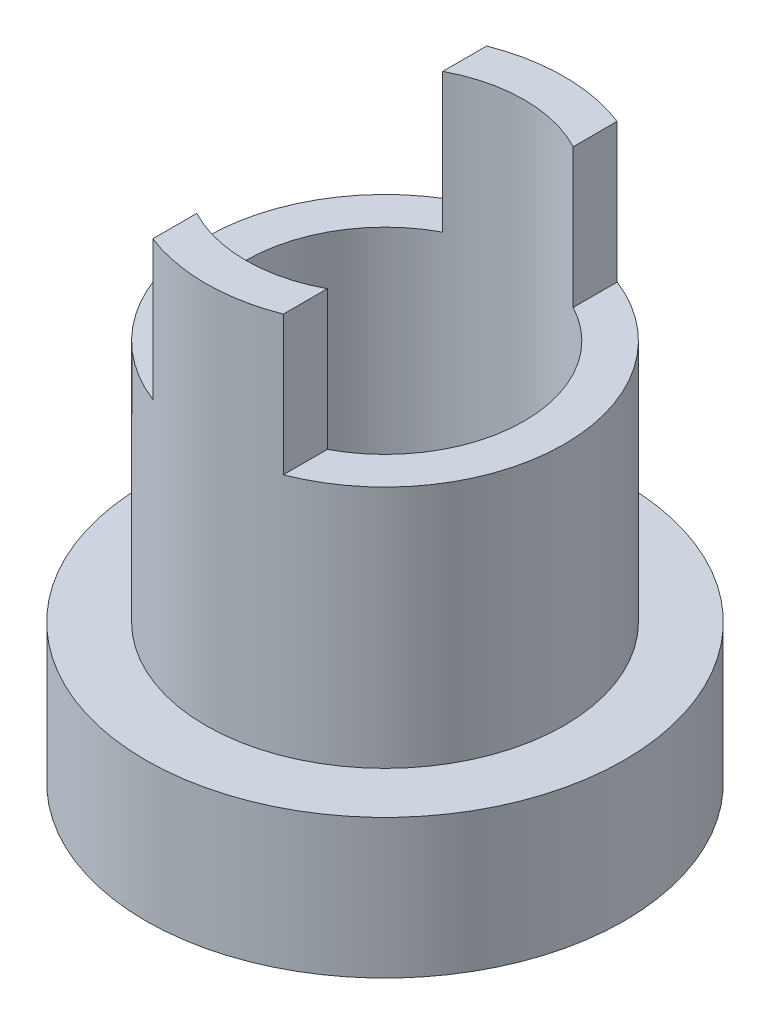
ISO-10303-21;
HEADER;
FILE_DESCRIPTION(('STEP AP214'),'2;1');
FILE_NAME('part.step','',(''),(''),'','','');
FILE_SCHEMA(('AUTOMOTIVE_DESIGN { 1 0 10303 214 1 1 1 1 }'));
ENDSEC;
DATA;
#1=APPLICATION_CONTEXT('core data for automotive mechanical design processes');
#2=APPLICATION_PROTOCOL_DEFINITION('international standard','automotive_design',2000,#1);
#3=PRODUCT_CONTEXT('',#1,'mechanical');
#4=PRODUCT('Part','Part','',(#3));
#5=PRODUCT_RELATED_PRODUCT_CATEGORY('part','',(#4));
#6=PRODUCT_DEFINITION_FORMATION('','',#4);
#7=PRODUCT_DEFINITION_CONTEXT('part definition',#1,'design');
#8=PRODUCT_DEFINITION('design','',#6,#7);
#9=PRODUCT_DEFINITION_SHAPE('','',#8);
#10=(LENGTH_UNIT() NAMED_UNIT(*) SI_UNIT(.MILLI.,.METRE.));
#11=(NAMED_UNIT(*) PLANE_ANGLE_UNIT() SI_UNIT($,.RADIAN.));
#12=(NAMED_UNIT(*) SI_UNIT($,.STERADIAN.) SOLID_ANGLE_UNIT());
#13=UNCERTAINTY_MEASURE_WITH_UNIT(LENGTH_MEASURE(1.E-05),#10,'distance_accuracy_value','');
#14=(GEOMETRIC_REPRESENTATION_CONTEXT(3) GLOBAL_UNCERTAINTY_ASSIGNED_CONTEXT((#13)) GLOBAL_UNIT_ASSIGNED_CONTEXT((#10,
#11,#12)) REPRESENTATION_CONTEXT('',''));
#15=CARTESIAN_POINT('',(0.,0.,0.));
#16=DIRECTION('',(0.,0.,1.));
#17=DIRECTION('',(1.,0.,0.));
#18=AXIS2_PLACEMENT_3D('',#15,#16,#17);
#19=CARTESIAN_POINT('',(0.,4.,0.));
#20=DIRECTION('',(0.,1.,0.));
#21=DIRECTION('',(0.,0.,1.));
#22=AXIS2_PLACEMENT_3D('',#19,#20,#21);
#23=PLANE('',#22);
#24=CARTESIAN_POINT('',(0.,4.,0.));
#25=DIRECTION('',(0.,1.,0.));
#26=DIRECTION('',(0.,0.,1.));
#27=AXIS2_PLACEMENT_3D('',#24,#25,#26);
#28=CIRCLE('',#27,5.15);
#29=CARTESIAN_POINT('',(0.,4.,5.15));
#30=VERTEX_POINT('',#29);
#31=EDGE_CURVE('E19',#30,#30,#28,.T.);
#32=ORIENTED_EDGE('',*,*,#31,.F.);
#33=EDGE_LOOP('',(#32));
#34=FACE_BOUND('',#33,.T.);
#35=CARTESIAN_POINT('',(0.,4.,0.));
#36=DIRECTION('',(0.,1.,0.));
#37=DIRECTION('',(0.,0.,1.));
#38=AXIS2_PLACEMENT_3D('',#35,#36,#37);
#39=CIRCLE('',#38,6.875);
#40=CARTESIAN_POINT('',(0.,4.,6.875));
#41=VERTEX_POINT('',#40);
#42=EDGE_CURVE('E103',#41,#41,#39,.F.);
#43=ORIENTED_EDGE('',*,*,#42,.F.);
#44=EDGE_LOOP('',(#43));
#45=FACE_BOUND('',#44,.T.);
#46=ADVANCED_FACE('F16',(#34,#45),#23,.T.);
#47=CARTESIAN_POINT('',(0.,4.,0.));
#48=DIRECTION('',(0.,1.,0.));
#49=DIRECTION('',(0.,0.,1.));
#50=AXIS2_PLACEMENT_3D('',#47,#48,#49);
#51=CYLINDRICAL_SURFACE('',#50,5.15);
#52=ORIENTED_EDGE('',*,*,#31,.T.);
#53=EDGE_LOOP('',(#52));
#54=FACE_BOUND('',#53,.T.);
#55=DIRECTION('',(0.,1.,0.));
#56=VECTOR('',#55,1.);
#57=CARTESIAN_POINT('',(1.875,13.,4.7965482380562));
#58=LINE('',#57,#56);
#59=CARTESIAN_POINT('',(1.875,15.,4.7965482380562));
#60=VERTEX_POINT('',#59);
#61=CARTESIAN_POINT('',(1.875,11.,4.7965482380562));
#62=VERTEX_POINT('',#61);
#63=EDGE_CURVE('E126',#60,#62,#58,.F.);
#64=ORIENTED_EDGE('',*,*,#63,.F.);
#65=CARTESIAN_POINT('',(0.,15.,0.));
#66=DIRECTION('',(0.,1.,0.));
#67=DIRECTION('',(0.,0.,1.));
#68=AXIS2_PLACEMENT_3D('',#65,#66,#67);
#69=CIRCLE('',#68,5.15);
#70=CARTESIAN_POINT('',(-1.875,15.,4.7965482380562));
#71=VERTEX_POINT('',#70);
#72=EDGE_CURVE('E112',#71,#60,#69,.T.);
#73=ORIENTED_EDGE('',*,*,#72,.F.);
#74=DIRECTION('',(0.,1.,0.));
#75=VECTOR('',#74,1.);
#76=CARTESIAN_POINT('',(-1.875,13.,4.7965482380562));
#77=LINE('',#76,#75);
#78=CARTESIAN_POINT('',(-1.875,11.,4.7965482380562));
#79=VERTEX_POINT('',#78);
#80=EDGE_CURVE('E106',#71,#79,#77,.F.);
#81=ORIENTED_EDGE('',*,*,#80,.T.);
#82=CARTESIAN_POINT('',(0.,11.,0.));
#83=DIRECTION('',(0.,1.,0.));
#84=DIRECTION('',(0.,0.,1.));
#85=AXIS2_PLACEMENT_3D('',#82,#83,#84);
#86=CIRCLE('',#85,5.15);
#87=CARTESIAN_POINT('',(-1.875,11.,-4.7965482380562));
#88=VERTEX_POINT('',#87);
#89=EDGE_CURVE('E93',#79,#88,#86,.F.);
#90=ORIENTED_EDGE('',*,*,#89,.T.);
#91=DIRECTION('',(0.,1.,0.));
#92=VECTOR('',#91,1.);
#93=CARTESIAN_POINT('',(-1.875,13.,-4.7965482380562));
#94=LINE('',#93,#92);
#95=CARTESIAN_POINT('',(-1.875,15.,-4.7965482380562));
#96=VERTEX_POINT('',#95);
#97=EDGE_CURVE('E136',#88,#96,#94,.T.);
#98=ORIENTED_EDGE('',*,*,#97,.T.);
#99=CARTESIAN_POINT('',(0.,15.,0.));
#100=DIRECTION('',(0.,1.,0.));
#101=DIRECTION('',(0.,0.,1.));
#102=AXIS2_PLACEMENT_3D('',#99,#100,#101);
#103=CIRCLE('',#102,5.15);
#104=CARTESIAN_POINT('',(1.875,15.,-4.7965482380562));
#105=VERTEX_POINT('',#104);
#106=EDGE_CURVE('E135',#105,#96,#103,.T.);
#107=ORIENTED_EDGE('',*,*,#106,.F.);
#108=DIRECTION('',(0.,1.,0.));
#109=VECTOR('',#108,1.);
#110=CARTESIAN_POINT('',(1.875,13.,-4.7965482380562));
#111=LINE('',#110,#109);
#112=CARTESIAN_POINT('',(1.875,11.,-4.7965482380562));
#113=VERTEX_POINT('',#112);
#114=EDGE_CURVE('E131',#113,#105,#111,.T.);
#115=ORIENTED_EDGE('',*,*,#114,.F.);
#116=CARTESIAN_POINT('',(0.,11.,0.));
#117=DIRECTION('',(0.,1.,0.));
#118=DIRECTION('',(0.,0.,1.));
#119=AXIS2_PLACEMENT_3D('',#116,#117,#118);
#120=CIRCLE('',#119,5.15);
#121=EDGE_CURVE('E130',#113,#62,#120,.F.);
#122=ORIENTED_EDGE('',*,*,#121,.T.);
#123=EDGE_LOOP('',(#64,#73,#81,#90,#98,#107,#115,#122));
#124=FACE_BOUND('',#123,.T.);
#125=ADVANCED_FACE('F111',(#54,#124),#51,.T.);
#126=CARTESIAN_POINT('',(0.,0.,0.));
#127=DIRECTION('',(0.,1.,0.));
#128=DIRECTION('',(0.,0.,1.));
#129=AXIS2_PLACEMENT_3D('',#126,#127,#128);
#130=CYLINDRICAL_SURFACE('',#129,6.875);
#131=CARTESIAN_POINT('',(0.,0.,0.));
#132=DIRECTION('',(0.,1.,0.));
#133=DIRECTION('',(0.,0.,1.));
#134=AXIS2_PLACEMENT_3D('',#131,#132,#133);
#135=CIRCLE('',#134,6.875);
#136=CARTESIAN_POINT('',(0.,0.,6.875));
#137=VERTEX_POINT('',#136);
#138=EDGE_CURVE('E114',#137,#137,#135,.T.);
#139=ORIENTED_EDGE('',*,*,#138,.T.);
#140=EDGE_LOOP('',(#139));
#141=FACE_BOUND('',#140,.T.);
#142=ORIENTED_EDGE('',*,*,#42,.T.);
#143=EDGE_LOOP('',(#142));
#144=FACE_BOUND('',#143,.T.);
#145=ADVANCED_FACE('F176',(#141,#144),#130,.T.);
#146=CARTESIAN_POINT('',(-1.875,11.,-6.23674060833547));
#147=DIRECTION('',(0.,-1.,0.));
#148=DIRECTION('',(0.,0.,-1.));
#149=AXIS2_PLACEMENT_3D('',#146,#147,#148);
#150=PLANE('',#149);
#151=DIRECTION('',(0.,0.,-1.));
#152=VECTOR('',#151,1.);
#153=CARTESIAN_POINT('',(-1.875,11.,-0.0726574679316326));
#154=LINE('',#153,#152);
#155=CARTESIAN_POINT('',(-1.875,11.,3.53332350627564));
#156=VERTEX_POINT('',#155);
#157=EDGE_CURVE('E97',#79,#156,#154,.T.);
#158=ORIENTED_EDGE('',*,*,#157,.T.);
#159=CARTESIAN_POINT('',(0.,11.,0.));
#160=DIRECTION('',(0.,1.,0.));
#161=DIRECTION('',(0.,0.,1.));
#162=AXIS2_PLACEMENT_3D('',#159,#160,#161);
#163=CIRCLE('',#162,4.);
#164=CARTESIAN_POINT('',(-1.875,11.,-3.53332350627564));
#165=VERTEX_POINT('',#164);
#166=EDGE_CURVE('E120',#156,#165,#163,.F.);
#167=ORIENTED_EDGE('',*,*,#166,.T.);
#168=DIRECTION('',(0.,0.,-1.));
#169=VECTOR('',#168,1.);
#170=CARTESIAN_POINT('',(-1.875,11.,-0.0726574679316326));
#171=LINE('',#170,#169);
#172=EDGE_CURVE('E98',#165,#88,#171,.T.);
#173=ORIENTED_EDGE('',*,*,#172,.T.);
#174=ORIENTED_EDGE('',*,*,#89,.F.);
#175=EDGE_LOOP('',(#158,#167,#173,#174));
#176=FACE_BOUND('',#175,.T.);
#177=ADVANCED_FACE('F95',(#176),#150,.F.);
#178=CARTESIAN_POINT('',(-1.875,13.,-0.0726574679316326));
#179=DIRECTION('',(1.,0.,0.));
#180=DIRECTION('',(0.,0.,-1.));
#181=AXIS2_PLACEMENT_3D('',#178,#179,#180);
#182=PLANE('',#181);
#183=ORIENTED_EDGE('',*,*,#172,.F.);
#184=DIRECTION('',(0.,1.,0.));
#185=VECTOR('',#184,1.);
#186=CARTESIAN_POINT('',(-1.875,0.,-3.53332350627564));
#187=LINE('',#186,#185);
#188=CARTESIAN_POINT('',(-1.875,15.,-3.53332350627564));
#189=VERTEX_POINT('',#188);
#190=EDGE_CURVE('E152',#165,#189,#187,.T.);
#191=ORIENTED_EDGE('',*,*,#190,.T.);
#192=DIRECTION('',(0.,0.,1.));
#193=VECTOR('',#192,1.);
#194=CARTESIAN_POINT('',(-1.875,15.,0.));
#195=LINE('',#194,#193);
#196=EDGE_CURVE('E137',#96,#189,#195,.T.);
#197=ORIENTED_EDGE('',*,*,#196,.F.);
#198=ORIENTED_EDGE('',*,*,#97,.F.);
#199=EDGE_LOOP('',(#183,#191,#197,#198));
#200=FACE_BOUND('',#199,.T.);
#201=ADVANCED_FACE('F210',(#200),#182,.F.);
#202=CARTESIAN_POINT('',(0.,15.,0.));
#203=DIRECTION('',(0.,1.,0.));
#204=DIRECTION('',(0.,0.,1.));
#205=AXIS2_PLACEMENT_3D('',#202,#203,#204);
#206=PLANE('',#205);
#207=DIRECTION('',(0.,0.,-1.));
#208=VECTOR('',#207,1.);
#209=CARTESIAN_POINT('',(1.875,15.,0.));
#210=LINE('',#209,#208);
#211=CARTESIAN_POINT('',(1.875,15.,-3.53332350627564));
#212=VERTEX_POINT('',#211);
#213=EDGE_CURVE('E134',#105,#212,#210,.F.);
#214=ORIENTED_EDGE('',*,*,#213,.F.);
#215=ORIENTED_EDGE('',*,*,#106,.T.);
#216=ORIENTED_EDGE('',*,*,#196,.T.);
#217=CARTESIAN_POINT('',(0.,15.,0.));
#218=DIRECTION('',(0.,1.,0.));
#219=DIRECTION('',(0.,0.,1.));
#220=AXIS2_PLACEMENT_3D('',#217,#218,#219);
#221=CIRCLE('',#220,4.);
#222=EDGE_CURVE('E149',#189,#212,#221,.F.);
#223=ORIENTED_EDGE('',*,*,#222,.T.);
#224=EDGE_LOOP('',(#214,#215,#216,#223));
#225=FACE_BOUND('',#224,.T.);
#226=ADVANCED_FACE('F206',(#225),#206,.T.);
#227=CARTESIAN_POINT('',(1.875,13.,0.));
#228=DIRECTION('',(1.,0.,0.));
#229=DIRECTION('',(0.,0.,-1.));
#230=AXIS2_PLACEMENT_3D('',#227,#228,#229);
#231=PLANE('',#230);
#232=DIRECTION('',(0.,1.,0.));
#233=VECTOR('',#232,1.);
#234=CARTESIAN_POINT('',(1.875,0.,-3.53332350627564));
#235=LINE('',#234,#233);
#236=CARTESIAN_POINT('',(1.875,11.,-3.53332350627564));
#237=VERTEX_POINT('',#236);
#238=EDGE_CURVE('E148',#212,#237,#235,.F.);
#239=ORIENTED_EDGE('',*,*,#238,.T.);
#240=DIRECTION('',(0.,0.,-1.));
#241=VECTOR('',#240,1.);
#242=CARTESIAN_POINT('',(1.875,11.,5.15));
#243=LINE('',#242,#241);
#244=EDGE_CURVE('E159',#237,#113,#243,.T.);
#245=ORIENTED_EDGE('',*,*,#244,.T.);
#246=ORIENTED_EDGE('',*,*,#114,.T.);
#247=ORIENTED_EDGE('',*,*,#213,.T.);
#248=EDGE_LOOP('',(#239,#245,#246,#247));
#249=FACE_BOUND('',#248,.T.);
#250=ADVANCED_FACE('F202',(#249),#231,.T.);
#251=CARTESIAN_POINT('',(1.875,11.,5.15));
#252=DIRECTION('',(0.,-1.,0.));
#253=DIRECTION('',(0.,0.,-1.));
#254=AXIS2_PLACEMENT_3D('',#251,#252,#253);
#255=PLANE('',#254);
#256=ORIENTED_EDGE('',*,*,#244,.F.);
#257=CARTESIAN_POINT('',(0.,11.,0.));
#258=DIRECTION('',(0.,1.,0.));
#259=DIRECTION('',(0.,0.,1.));
#260=AXIS2_PLACEMENT_3D('',#257,#258,#259);
#261=CIRCLE('',#260,4.);
#262=CARTESIAN_POINT('',(1.875,11.,3.53332350627564));
#263=VERTEX_POINT('',#262);
#264=EDGE_CURVE('E144',#237,#263,#261,.F.);
#265=ORIENTED_EDGE('',*,*,#264,.T.);
#266=DIRECTION('',(0.,0.,-1.));
#267=VECTOR('',#266,1.);
#268=CARTESIAN_POINT('',(1.875,11.,0.));
#269=LINE('',#268,#267);
#270=EDGE_CURVE('E129',#62,#263,#269,.T.);
#271=ORIENTED_EDGE('',*,*,#270,.F.);
#272=ORIENTED_EDGE('',*,*,#121,.F.);
#273=EDGE_LOOP('',(#256,#265,#271,#272));
#274=FACE_BOUND('',#273,.T.);
#275=ADVANCED_FACE('F198',(#274),#255,.F.);
#276=CARTESIAN_POINT('',(1.875,13.,0.));
#277=DIRECTION('',(1.,0.,0.));
#278=DIRECTION('',(0.,0.,-1.));
#279=AXIS2_PLACEMENT_3D('',#276,#277,#278);
#280=PLANE('',#279);
#281=DIRECTION('',(0.,1.,0.));
#282=VECTOR('',#281,1.);
#283=CARTESIAN_POINT('',(1.875,0.,3.53332350627564));
#284=LINE('',#283,#282);
#285=CARTESIAN_POINT('',(1.875,15.,3.53332350627564));
#286=VERTEX_POINT('',#285);
#287=EDGE_CURVE('E143',#263,#286,#284,.T.);
#288=ORIENTED_EDGE('',*,*,#287,.T.);
#289=DIRECTION('',(0.,0.,1.));
#290=VECTOR('',#289,1.);
#291=CARTESIAN_POINT('',(1.875,15.,0.));
#292=LINE('',#291,#290);
#293=EDGE_CURVE('E108',#60,#286,#292,.F.);
#294=ORIENTED_EDGE('',*,*,#293,.F.);
#295=ORIENTED_EDGE('',*,*,#63,.T.);
#296=ORIENTED_EDGE('',*,*,#270,.T.);
#297=EDGE_LOOP('',(#288,#294,#295,#296));
#298=FACE_BOUND('',#297,.T.);
#299=ADVANCED_FACE('F195',(#298),#280,.T.);
#300=CARTESIAN_POINT('',(0.,15.,0.));
#301=DIRECTION('',(0.,1.,0.));
#302=DIRECTION('',(0.,0.,1.));
#303=AXIS2_PLACEMENT_3D('',#300,#301,#302);
#304=PLANE('',#303);
#305=ORIENTED_EDGE('',*,*,#293,.T.);
#306=CARTESIAN_POINT('',(0.,15.,0.));
#307=DIRECTION('',(0.,1.,0.));
#308=DIRECTION('',(0.,0.,1.));
#309=AXIS2_PLACEMENT_3D('',#306,#307,#308);
#310=CIRCLE('',#309,4.);
#311=CARTESIAN_POINT('',(-1.875,15.,3.53332350627564));
#312=VERTEX_POINT('',#311);
#313=EDGE_CURVE('E139',#286,#312,#310,.F.);
#314=ORIENTED_EDGE('',*,*,#313,.T.);
#315=DIRECTION('',(0.,0.,-1.));
#316=VECTOR('',#315,1.);
#317=CARTESIAN_POINT('',(-1.875,15.,-0.0726574679316326));
#318=LINE('',#317,#316);
#319=EDGE_CURVE('E38',#312,#71,#318,.F.);
#320=ORIENTED_EDGE('',*,*,#319,.T.);
#321=ORIENTED_EDGE('',*,*,#72,.T.);
#322=EDGE_LOOP('',(#305,#314,#320,#321));
#323=FACE_BOUND('',#322,.T.);
#324=ADVANCED_FACE('F192',(#323),#304,.T.);
#325=CARTESIAN_POINT('',(-1.875,13.,-0.0726574679316326));
#326=DIRECTION('',(1.,0.,0.));
#327=DIRECTION('',(0.,0.,-1.));
#328=AXIS2_PLACEMENT_3D('',#325,#326,#327);
#329=PLANE('',#328);
#330=ORIENTED_EDGE('',*,*,#319,.F.);
#331=DIRECTION('',(0.,1.,0.));
#332=VECTOR('',#331,1.);
#333=CARTESIAN_POINT('',(-1.875,0.,3.53332350627564));
#334=LINE('',#333,#332);
#335=EDGE_CURVE('E26',#312,#156,#334,.F.);
#336=ORIENTED_EDGE('',*,*,#335,.T.);
#337=ORIENTED_EDGE('',*,*,#157,.F.);
#338=ORIENTED_EDGE('',*,*,#80,.F.);
#339=EDGE_LOOP('',(#330,#336,#337,#338));
#340=FACE_BOUND('',#339,.T.);
#341=ADVANCED_FACE('F105',(#340),#329,.F.);
#342=CARTESIAN_POINT('',(0.,0.,0.));
#343=DIRECTION('',(0.,1.,0.));
#344=DIRECTION('',(0.,0.,1.));
#345=AXIS2_PLACEMENT_3D('',#342,#343,#344);
#346=PLANE('',#345);
#347=CARTESIAN_POINT('',(0.,0.,0.));
#348=DIRECTION('',(0.,1.,0.));
#349=DIRECTION('',(0.,0.,1.));
#350=AXIS2_PLACEMENT_3D('',#347,#348,#349);
#351=CIRCLE('',#350,4.);
#352=CARTESIAN_POINT('',(0.,0.,4.));
#353=VERTEX_POINT('',#352);
#354=EDGE_CURVE('E11',#353,#353,#351,.T.);
#355=ORIENTED_EDGE('',*,*,#354,.T.);
#356=EDGE_LOOP('',(#355));
#357=FACE_BOUND('',#356,.T.);
#358=ORIENTED_EDGE('',*,*,#138,.F.);
#359=EDGE_LOOP('',(#358));
#360=FACE_BOUND('',#359,.T.);
#361=ADVANCED_FACE('F179',(#357,#360),#346,.F.);
#362=CARTESIAN_POINT('',(0.,0.,0.));
#363=DIRECTION('',(0.,1.,0.));
#364=DIRECTION('',(0.,0.,1.));
#365=AXIS2_PLACEMENT_3D('',#362,#363,#364);
#366=CYLINDRICAL_SURFACE('',#365,4.);
#367=ORIENTED_EDGE('',*,*,#354,.F.);
#368=EDGE_LOOP('',(#367));
#369=FACE_BOUND('',#368,.T.);
#370=ORIENTED_EDGE('',*,*,#313,.F.);
#371=ORIENTED_EDGE('',*,*,#287,.F.);
#372=ORIENTED_EDGE('',*,*,#264,.F.);
#373=ORIENTED_EDGE('',*,*,#238,.F.);
#374=ORIENTED_EDGE('',*,*,#222,.F.);
#375=ORIENTED_EDGE('',*,*,#190,.F.);
#376=ORIENTED_EDGE('',*,*,#166,.F.);
#377=ORIENTED_EDGE('',*,*,#335,.F.);
#378=EDGE_LOOP('',(#370,#371,#372,#373,#374,#375,#376,#377));
#379=FACE_BOUND('',#378,.T.);
#380=ADVANCED_FACE('F177',(#369,#379),#366,.F.);
#381=CLOSED_SHELL('',(#46,#125,#145,#177,#201,#226,#250,#275,#299,#324,#341,#361,#380));
#382=MANIFOLD_SOLID_BREP('B1',#381);
#383=ADVANCED_BREP_SHAPE_REPRESENTATION('',(#18,#382),#14);
#384=SHAPE_DEFINITION_REPRESENTATION(#9,#383);
ENDSEC;
END-ISO-10303-21;
